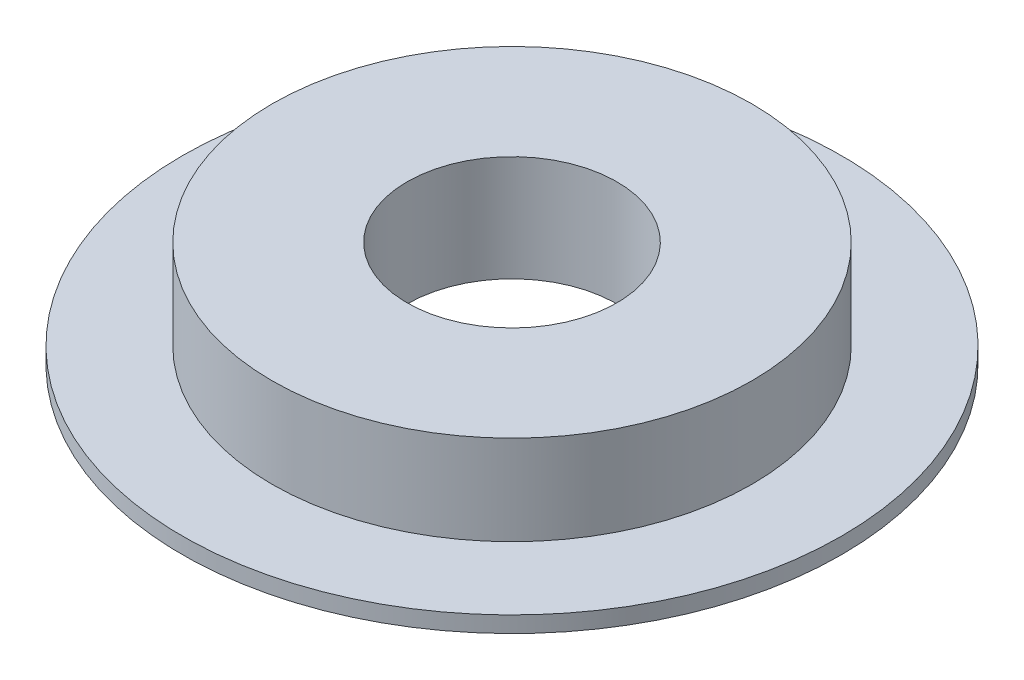
ISO-10303-21;
HEADER;
FILE_DESCRIPTION(('STEP AP214'),'2;1');
FILE_NAME('part.step','',(''),(''),'','','');
FILE_SCHEMA(('AUTOMOTIVE_DESIGN { 1 0 10303 214 1 1 1 1 }'));
ENDSEC;
DATA;
#1=APPLICATION_CONTEXT('core data for automotive mechanical design processes');
#2=APPLICATION_PROTOCOL_DEFINITION('international standard','automotive_design',2000,#1);
#3=PRODUCT_CONTEXT('',#1,'mechanical');
#4=PRODUCT('Part','Part','',(#3));
#5=PRODUCT_RELATED_PRODUCT_CATEGORY('part','',(#4));
#6=PRODUCT_DEFINITION_FORMATION('','',#4);
#7=PRODUCT_DEFINITION_CONTEXT('part definition',#1,'design');
#8=PRODUCT_DEFINITION('design','',#6,#7);
#9=PRODUCT_DEFINITION_SHAPE('','',#8);
#10=(LENGTH_UNIT() NAMED_UNIT(*) SI_UNIT(.MILLI.,.METRE.));
#11=(NAMED_UNIT(*) PLANE_ANGLE_UNIT() SI_UNIT($,.RADIAN.));
#12=(NAMED_UNIT(*) SI_UNIT($,.STERADIAN.) SOLID_ANGLE_UNIT());
#13=UNCERTAINTY_MEASURE_WITH_UNIT(LENGTH_MEASURE(1.E-05),#10,'distance_accuracy_value','');
#14=(GEOMETRIC_REPRESENTATION_CONTEXT(3) GLOBAL_UNCERTAINTY_ASSIGNED_CONTEXT((#13)) GLOBAL_UNIT_ASSIGNED_CONTEXT((#10,
#11,#12)) REPRESENTATION_CONTEXT('',''));
#15=CARTESIAN_POINT('',(0.,0.,0.));
#16=DIRECTION('',(0.,0.,1.));
#17=DIRECTION('',(1.,0.,0.));
#18=AXIS2_PLACEMENT_3D('',#15,#16,#17);
#19=CARTESIAN_POINT('',(-40.9715872800419,8.97288931788123,0.));
#20=DIRECTION('',(0.,1.,0.));
#21=DIRECTION('',(-1.,0.,0.));
#22=AXIS2_PLACEMENT_3D('',#19,#20,#21);
#23=PLANE('',#22);
#24=CARTESIAN_POINT('',(-29.2715872800419,8.97288931788123,0.));
#25=DIRECTION('',(0.,1.,0.));
#26=DIRECTION('',(-1.,0.,0.));
#27=AXIS2_PLACEMENT_3D('',#24,#25,#26);
#28=CIRCLE('',#27,26.75);
#29=CARTESIAN_POINT('',(-56.0215872800419,8.97288931788123,0.));
#30=VERTEX_POINT('',#29);
#31=EDGE_CURVE('E10',#30,#30,#28,.T.);
#32=ORIENTED_EDGE('',*,*,#31,.T.);
#33=EDGE_LOOP('',(#32));
#34=FACE_BOUND('',#33,.T.);
#35=CARTESIAN_POINT('',(-29.2715872800419,8.97288931788123,0.));
#36=DIRECTION('',(0.,1.,0.));
#37=DIRECTION('',(-1.,0.,0.));
#38=AXIS2_PLACEMENT_3D('',#35,#36,#37);
#39=CIRCLE('',#38,11.7);
#40=CARTESIAN_POINT('',(-40.9715872800419,8.97288931788123,0.));
#41=VERTEX_POINT('',#40);
#42=EDGE_CURVE('E53',#41,#41,#39,.T.);
#43=ORIENTED_EDGE('',*,*,#42,.F.);
#44=EDGE_LOOP('',(#43));
#45=FACE_BOUND('',#44,.T.);
#46=ADVANCED_FACE('F31',(#34,#45),#23,.T.);
#47=CARTESIAN_POINT('',(-29.2715872800419,13.9728893178812,0.));
#48=DIRECTION('',(0.,1.,0.));
#49=DIRECTION('',(-1.,0.,0.));
#50=AXIS2_PLACEMENT_3D('',#47,#48,#49);
#51=CYLINDRICAL_SURFACE('',#50,26.75);
#52=CARTESIAN_POINT('',(-29.2715872800419,-1.02711068211877,0.));
#53=DIRECTION('',(0.,1.,0.));
#54=DIRECTION('',(-1.,0.,0.));
#55=AXIS2_PLACEMENT_3D('',#52,#53,#54);
#56=CIRCLE('',#55,26.75);
#57=CARTESIAN_POINT('',(-56.0215872800419,-1.02711068211877,0.));
#58=VERTEX_POINT('',#57);
#59=EDGE_CURVE('E37',#58,#58,#56,.T.);
#60=ORIENTED_EDGE('',*,*,#59,.T.);
#61=EDGE_LOOP('',(#60));
#62=FACE_BOUND('',#61,.T.);
#63=ORIENTED_EDGE('',*,*,#31,.F.);
#64=EDGE_LOOP('',(#63));
#65=FACE_BOUND('',#64,.T.);
#66=ADVANCED_FACE('F61',(#62,#65),#51,.T.);
#67=CARTESIAN_POINT('',(-56.0215872800419,-1.02711068211877,0.));
#68=DIRECTION('',(0.,1.,0.));
#69=DIRECTION('',(-1.,0.,0.));
#70=AXIS2_PLACEMENT_3D('',#67,#68,#69);
#71=PLANE('',#70);
#72=CARTESIAN_POINT('',(-29.2715872800419,-1.02711068211877,0.));
#73=DIRECTION('',(0.,1.,0.));
#74=DIRECTION('',(-1.,0.,0.));
#75=AXIS2_PLACEMENT_3D('',#72,#73,#74);
#76=CIRCLE('',#75,36.75);
#77=CARTESIAN_POINT('',(-66.0215872800419,-1.02711068211877,0.));
#78=VERTEX_POINT('',#77);
#79=EDGE_CURVE('E41',#78,#78,#76,.T.);
#80=ORIENTED_EDGE('',*,*,#79,.T.);
#81=EDGE_LOOP('',(#80));
#82=FACE_BOUND('',#81,.T.);
#83=ORIENTED_EDGE('',*,*,#59,.F.);
#84=EDGE_LOOP('',(#83));
#85=FACE_BOUND('',#84,.T.);
#86=ADVANCED_FACE('F65',(#82,#85),#71,.T.);
#87=CARTESIAN_POINT('',(-29.2715872800419,13.9728893178812,0.));
#88=DIRECTION('',(0.,1.,0.));
#89=DIRECTION('',(-1.,0.,0.));
#90=AXIS2_PLACEMENT_3D('',#87,#88,#89);
#91=CYLINDRICAL_SURFACE('',#90,36.75);
#92=CARTESIAN_POINT('',(-29.2715872800419,-2.82711068211877,0.));
#93=DIRECTION('',(0.,1.,0.));
#94=DIRECTION('',(-1.,0.,0.));
#95=AXIS2_PLACEMENT_3D('',#92,#93,#94);
#96=CIRCLE('',#95,36.75);
#97=CARTESIAN_POINT('',(-66.0215872800419,-2.82711068211877,0.));
#98=VERTEX_POINT('',#97);
#99=EDGE_CURVE('E45',#98,#98,#96,.T.);
#100=ORIENTED_EDGE('',*,*,#99,.T.);
#101=EDGE_LOOP('',(#100));
#102=FACE_BOUND('',#101,.T.);
#103=ORIENTED_EDGE('',*,*,#79,.F.);
#104=EDGE_LOOP('',(#103));
#105=FACE_BOUND('',#104,.T.);
#106=ADVANCED_FACE('F69',(#102,#105),#91,.T.);
#107=CARTESIAN_POINT('',(-66.0215872800419,-2.82711068211877,0.));
#108=DIRECTION('',(0.,-1.,0.));
#109=DIRECTION('',(1.,0.,0.));
#110=AXIS2_PLACEMENT_3D('',#107,#108,#109);
#111=PLANE('',#110);
#112=CARTESIAN_POINT('',(-29.2715872800419,-2.82711068211877,0.));
#113=DIRECTION('',(0.,1.,0.));
#114=DIRECTION('',(-1.,0.,0.));
#115=AXIS2_PLACEMENT_3D('',#112,#113,#114);
#116=CIRCLE('',#115,11.7);
#117=CARTESIAN_POINT('',(-40.9715872800419,-2.82711068211877,0.));
#118=VERTEX_POINT('',#117);
#119=EDGE_CURVE('E50',#118,#118,#116,.T.);
#120=ORIENTED_EDGE('',*,*,#119,.T.);
#121=EDGE_LOOP('',(#120));
#122=FACE_BOUND('',#121,.T.);
#123=ORIENTED_EDGE('',*,*,#99,.F.);
#124=EDGE_LOOP('',(#123));
#125=FACE_BOUND('',#124,.T.);
#126=ADVANCED_FACE('F76',(#122,#125),#111,.T.);
#127=CARTESIAN_POINT('',(-29.2715872800419,13.9728893178812,0.));
#128=DIRECTION('',(0.,1.,0.));
#129=DIRECTION('',(-1.,0.,0.));
#130=AXIS2_PLACEMENT_3D('',#127,#128,#129);
#131=CYLINDRICAL_SURFACE('',#130,11.7);
#132=ORIENTED_EDGE('',*,*,#42,.T.);
#133=EDGE_LOOP('',(#132));
#134=FACE_BOUND('',#133,.T.);
#135=ORIENTED_EDGE('',*,*,#119,.F.);
#136=EDGE_LOOP('',(#135));
#137=FACE_BOUND('',#136,.T.);
#138=ADVANCED_FACE('F57',(#134,#137),#131,.F.);
#139=CLOSED_SHELL('',(#46,#66,#86,#106,#126,#138));
#140=MANIFOLD_SOLID_BREP('B2',#139);
#141=ADVANCED_BREP_SHAPE_REPRESENTATION('',(#18,#140),#14);
#142=SHAPE_DEFINITION_REPRESENTATION(#9,#141);
ENDSEC;
END-ISO-10303-21;
